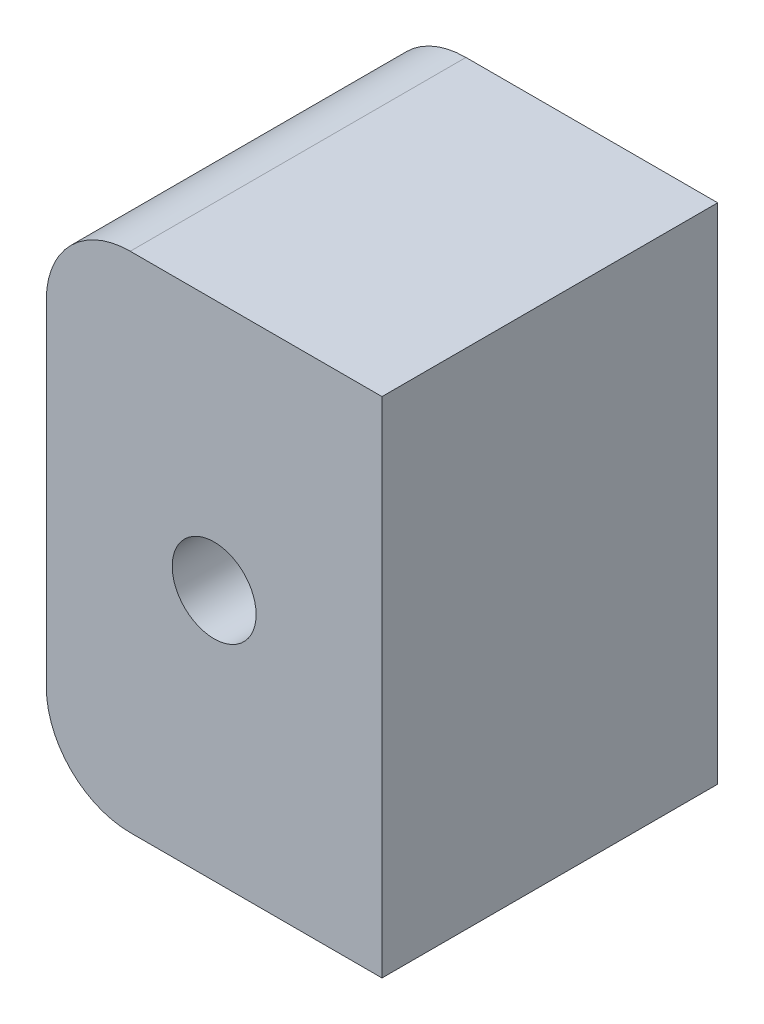
ISO-10303-21;
HEADER;
FILE_DESCRIPTION(('STEP AP214'),'2;1');
FILE_NAME('part.step','',(''),(''),'','','');
FILE_SCHEMA(('AUTOMOTIVE_DESIGN { 1 0 10303 214 1 1 1 1 }'));
ENDSEC;
DATA;
#1=APPLICATION_CONTEXT('core data for automotive mechanical design processes');
#2=APPLICATION_PROTOCOL_DEFINITION('international standard','automotive_design',2000,#1);
#3=PRODUCT_CONTEXT('',#1,'mechanical');
#4=PRODUCT('Part','Part','',(#3));
#5=PRODUCT_RELATED_PRODUCT_CATEGORY('part','',(#4));
#6=PRODUCT_DEFINITION_FORMATION('','',#4);
#7=PRODUCT_DEFINITION_CONTEXT('part definition',#1,'design');
#8=PRODUCT_DEFINITION('design','',#6,#7);
#9=PRODUCT_DEFINITION_SHAPE('','',#8);
#10=(LENGTH_UNIT() NAMED_UNIT(*) SI_UNIT(.MILLI.,.METRE.));
#11=(NAMED_UNIT(*) PLANE_ANGLE_UNIT() SI_UNIT($,.RADIAN.));
#12=(NAMED_UNIT(*) SI_UNIT($,.STERADIAN.) SOLID_ANGLE_UNIT());
#13=UNCERTAINTY_MEASURE_WITH_UNIT(LENGTH_MEASURE(1.E-05),#10,'distance_accuracy_value','');
#14=(GEOMETRIC_REPRESENTATION_CONTEXT(3) GLOBAL_UNCERTAINTY_ASSIGNED_CONTEXT((#13)) GLOBAL_UNIT_ASSIGNED_CONTEXT((#10,
#11,#12)) REPRESENTATION_CONTEXT('',''));
#15=CARTESIAN_POINT('',(0.,0.,0.));
#16=DIRECTION('',(0.,0.,1.));
#17=DIRECTION('',(1.,0.,0.));
#18=AXIS2_PLACEMENT_3D('',#15,#16,#17);
#19=CARTESIAN_POINT('',(0.,15.,20.));
#20=DIRECTION('',(-1.,0.,0.));
#21=DIRECTION('',(0.,-1.,0.));
#22=AXIS2_PLACEMENT_3D('',#19,#20,#21);
#23=PLANE('',#22);
#24=DIRECTION('',(0.,1.,0.));
#25=VECTOR('',#24,1.);
#26=CARTESIAN_POINT('',(0.,15.,0.));
#27=LINE('',#26,#25);
#28=CARTESIAN_POINT('',(0.,-15.,0.));
#29=VERTEX_POINT('',#28);
#30=CARTESIAN_POINT('',(0.,15.,0.));
#31=VERTEX_POINT('',#30);
#32=EDGE_CURVE('E136',#29,#31,#27,.T.);
#33=ORIENTED_EDGE('',*,*,#32,.T.);
#34=DIRECTION('',(0.,0.,-1.));
#35=VECTOR('',#34,1.);
#36=CARTESIAN_POINT('',(0.,15.,20.));
#37=LINE('',#36,#35);
#38=CARTESIAN_POINT('',(0.,15.,20.));
#39=VERTEX_POINT('',#38);
#40=EDGE_CURVE('E11',#39,#31,#37,.T.);
#41=ORIENTED_EDGE('',*,*,#40,.F.);
#42=DIRECTION('',(0.,1.,0.));
#43=VECTOR('',#42,1.);
#44=CARTESIAN_POINT('',(0.,15.,20.));
#45=LINE('',#44,#43);
#46=CARTESIAN_POINT('',(0.,-15.,20.));
#47=VERTEX_POINT('',#46);
#48=EDGE_CURVE('E153',#47,#39,#45,.T.);
#49=ORIENTED_EDGE('',*,*,#48,.F.);
#50=DIRECTION('',(0.,0.,-1.));
#51=VECTOR('',#50,1.);
#52=CARTESIAN_POINT('',(0.,-15.,20.));
#53=LINE('',#52,#51);
#54=EDGE_CURVE('E132',#47,#29,#53,.T.);
#55=ORIENTED_EDGE('',*,*,#54,.T.);
#56=EDGE_LOOP('',(#33,#41,#49,#55));
#57=FACE_BOUND('',#56,.T.);
#58=ADVANCED_FACE('F47',(#57),#23,.F.);
#59=CARTESIAN_POINT('',(-15.,15.,20.));
#60=DIRECTION('',(0.,-1.,0.));
#61=DIRECTION('',(1.,0.,0.));
#62=AXIS2_PLACEMENT_3D('',#59,#60,#61);
#63=PLANE('',#62);
#64=DIRECTION('',(-1.,0.,0.));
#65=VECTOR('',#64,1.);
#66=CARTESIAN_POINT('',(-15.,15.,0.));
#67=LINE('',#66,#65);
#68=CARTESIAN_POINT('',(-15.,15.,0.));
#69=VERTEX_POINT('',#68);
#70=EDGE_CURVE('E140',#31,#69,#67,.T.);
#71=ORIENTED_EDGE('',*,*,#70,.T.);
#72=DIRECTION('',(0.,0.,-1.));
#73=VECTOR('',#72,1.);
#74=CARTESIAN_POINT('',(-15.,15.,20.));
#75=LINE('',#74,#73);
#76=CARTESIAN_POINT('',(-15.,15.,20.));
#77=VERTEX_POINT('',#76);
#78=EDGE_CURVE('E56',#77,#69,#75,.T.);
#79=ORIENTED_EDGE('',*,*,#78,.F.);
#80=DIRECTION('',(-1.,0.,0.));
#81=VECTOR('',#80,1.);
#82=CARTESIAN_POINT('',(-15.,15.,20.));
#83=LINE('',#82,#81);
#84=EDGE_CURVE('E101',#39,#77,#83,.T.);
#85=ORIENTED_EDGE('',*,*,#84,.F.);
#86=ORIENTED_EDGE('',*,*,#40,.T.);
#87=EDGE_LOOP('',(#71,#79,#85,#86));
#88=FACE_BOUND('',#87,.T.);
#89=ADVANCED_FACE('F182',(#88),#63,.F.);
#90=CARTESIAN_POINT('',(-15.,10.,20.));
#91=DIRECTION('',(0.,0.,-1.));
#92=DIRECTION('',(-1.,0.,0.));
#93=AXIS2_PLACEMENT_3D('',#90,#91,#92);
#94=CYLINDRICAL_SURFACE('',#93,5.);
#95=CARTESIAN_POINT('',(-15.,10.,0.));
#96=DIRECTION('',(0.,0.,1.));
#97=DIRECTION('',(-1.,0.,0.));
#98=AXIS2_PLACEMENT_3D('',#95,#96,#97);
#99=CIRCLE('',#98,5.);
#100=CARTESIAN_POINT('',(-20.,10.,0.));
#101=VERTEX_POINT('',#100);
#102=EDGE_CURVE('E144',#69,#101,#99,.T.);
#103=ORIENTED_EDGE('',*,*,#102,.T.);
#104=DIRECTION('',(0.,0.,-1.));
#105=VECTOR('',#104,1.);
#106=CARTESIAN_POINT('',(-20.,10.,20.));
#107=LINE('',#106,#105);
#108=CARTESIAN_POINT('',(-20.,10.,20.));
#109=VERTEX_POINT('',#108);
#110=EDGE_CURVE('E125',#109,#101,#107,.T.);
#111=ORIENTED_EDGE('',*,*,#110,.F.);
#112=CARTESIAN_POINT('',(-15.,10.,20.));
#113=DIRECTION('',(0.,0.,1.));
#114=DIRECTION('',(-1.,0.,0.));
#115=AXIS2_PLACEMENT_3D('',#112,#113,#114);
#116=CIRCLE('',#115,5.);
#117=EDGE_CURVE('E114',#77,#109,#116,.T.);
#118=ORIENTED_EDGE('',*,*,#117,.F.);
#119=ORIENTED_EDGE('',*,*,#78,.T.);
#120=EDGE_LOOP('',(#103,#111,#118,#119));
#121=FACE_BOUND('',#120,.T.);
#122=ADVANCED_FACE('F163',(#121),#94,.T.);
#123=CARTESIAN_POINT('',(-20.,10.,20.));
#124=DIRECTION('',(1.,0.,0.));
#125=DIRECTION('',(0.,1.,0.));
#126=AXIS2_PLACEMENT_3D('',#123,#124,#125);
#127=PLANE('',#126);
#128=DIRECTION('',(0.,-1.,0.));
#129=VECTOR('',#128,1.);
#130=CARTESIAN_POINT('',(-20.,10.,0.));
#131=LINE('',#130,#129);
#132=CARTESIAN_POINT('',(-20.,-10.,0.));
#133=VERTEX_POINT('',#132);
#134=EDGE_CURVE('E123',#101,#133,#131,.T.);
#135=ORIENTED_EDGE('',*,*,#134,.T.);
#136=DIRECTION('',(0.,0.,-1.));
#137=VECTOR('',#136,1.);
#138=CARTESIAN_POINT('',(-20.,-10.,20.));
#139=LINE('',#138,#137);
#140=CARTESIAN_POINT('',(-20.,-10.,20.));
#141=VERTEX_POINT('',#140);
#142=EDGE_CURVE('E120',#141,#133,#139,.T.);
#143=ORIENTED_EDGE('',*,*,#142,.F.);
#144=DIRECTION('',(0.,-1.,0.));
#145=VECTOR('',#144,1.);
#146=CARTESIAN_POINT('',(-20.,10.,20.));
#147=LINE('',#146,#145);
#148=EDGE_CURVE('E108',#109,#141,#147,.T.);
#149=ORIENTED_EDGE('',*,*,#148,.F.);
#150=ORIENTED_EDGE('',*,*,#110,.T.);
#151=EDGE_LOOP('',(#135,#143,#149,#150));
#152=FACE_BOUND('',#151,.T.);
#153=ADVANCED_FACE('F121',(#152),#127,.F.);
#154=CARTESIAN_POINT('',(-15.,-10.,20.));
#155=DIRECTION('',(0.,0.,-1.));
#156=DIRECTION('',(-1.,0.,0.));
#157=AXIS2_PLACEMENT_3D('',#154,#155,#156);
#158=CYLINDRICAL_SURFACE('',#157,5.);
#159=CARTESIAN_POINT('',(-15.,-10.,0.));
#160=DIRECTION('',(0.,0.,1.));
#161=DIRECTION('',(1.,0.,0.));
#162=AXIS2_PLACEMENT_3D('',#159,#160,#161);
#163=CIRCLE('',#162,5.);
#164=CARTESIAN_POINT('',(-15.,-15.,0.));
#165=VERTEX_POINT('',#164);
#166=EDGE_CURVE('E87',#133,#165,#163,.T.);
#167=ORIENTED_EDGE('',*,*,#166,.T.);
#168=DIRECTION('',(0.,0.,-1.));
#169=VECTOR('',#168,1.);
#170=CARTESIAN_POINT('',(-15.,-15.,20.));
#171=LINE('',#170,#169);
#172=CARTESIAN_POINT('',(-15.,-15.,20.));
#173=VERTEX_POINT('',#172);
#174=EDGE_CURVE('E126',#173,#165,#171,.T.);
#175=ORIENTED_EDGE('',*,*,#174,.F.);
#176=CARTESIAN_POINT('',(-15.,-10.,20.));
#177=DIRECTION('',(0.,0.,1.));
#178=DIRECTION('',(1.,0.,0.));
#179=AXIS2_PLACEMENT_3D('',#176,#177,#178);
#180=CIRCLE('',#179,5.);
#181=EDGE_CURVE('E112',#141,#173,#180,.T.);
#182=ORIENTED_EDGE('',*,*,#181,.F.);
#183=ORIENTED_EDGE('',*,*,#142,.T.);
#184=EDGE_LOOP('',(#167,#175,#182,#183));
#185=FACE_BOUND('',#184,.T.);
#186=ADVANCED_FACE('F128',(#185),#158,.T.);
#187=CARTESIAN_POINT('',(-15.,-15.,20.));
#188=DIRECTION('',(0.,1.,0.));
#189=DIRECTION('',(-1.,0.,0.));
#190=AXIS2_PLACEMENT_3D('',#187,#188,#189);
#191=PLANE('',#190);
#192=DIRECTION('',(1.,0.,0.));
#193=VECTOR('',#192,1.);
#194=CARTESIAN_POINT('',(-15.,-15.,0.));
#195=LINE('',#194,#193);
#196=EDGE_CURVE('E93',#165,#29,#195,.T.);
#197=ORIENTED_EDGE('',*,*,#196,.T.);
#198=ORIENTED_EDGE('',*,*,#54,.F.);
#199=DIRECTION('',(1.,0.,0.));
#200=VECTOR('',#199,1.);
#201=CARTESIAN_POINT('',(-15.,-15.,20.));
#202=LINE('',#201,#200);
#203=EDGE_CURVE('E64',#173,#47,#202,.T.);
#204=ORIENTED_EDGE('',*,*,#203,.F.);
#205=ORIENTED_EDGE('',*,*,#174,.T.);
#206=EDGE_LOOP('',(#197,#198,#204,#205));
#207=FACE_BOUND('',#206,.T.);
#208=ADVANCED_FACE('F170',(#207),#191,.F.);
#209=CARTESIAN_POINT('',(-15.,-10.,20.));
#210=DIRECTION('',(0.,0.,1.));
#211=DIRECTION('',(1.,0.,0.));
#212=AXIS2_PLACEMENT_3D('',#209,#210,#211);
#213=PLANE('',#212);
#214=CARTESIAN_POINT('',(-9.99999999999999,0.,20.));
#215=DIRECTION('',(0.,0.,1.));
#216=DIRECTION('',(1.,0.,0.));
#217=AXIS2_PLACEMENT_3D('',#214,#215,#216);
#218=CIRCLE('',#217,2.5);
#219=CARTESIAN_POINT('',(-7.49999999999999,0.,20.));
#220=VERTEX_POINT('',#219);
#221=EDGE_CURVE('E141',#220,#220,#218,.T.);
#222=ORIENTED_EDGE('',*,*,#221,.F.);
#223=EDGE_LOOP('',(#222));
#224=FACE_BOUND('',#223,.T.);
#225=ORIENTED_EDGE('',*,*,#48,.T.);
#226=ORIENTED_EDGE('',*,*,#84,.T.);
#227=ORIENTED_EDGE('',*,*,#117,.T.);
#228=ORIENTED_EDGE('',*,*,#148,.T.);
#229=ORIENTED_EDGE('',*,*,#181,.T.);
#230=ORIENTED_EDGE('',*,*,#203,.T.);
#231=EDGE_LOOP('',(#225,#226,#227,#228,#229,#230));
#232=FACE_BOUND('',#231,.T.);
#233=ADVANCED_FACE('F110',(#224,#232),#213,.T.);
#234=CARTESIAN_POINT('',(-15.,-10.,0.));
#235=DIRECTION('',(0.,0.,1.));
#236=DIRECTION('',(1.,0.,0.));
#237=AXIS2_PLACEMENT_3D('',#234,#235,#236);
#238=PLANE('',#237);
#239=CARTESIAN_POINT('',(-9.99999999999999,0.,0.));
#240=DIRECTION('',(0.,0.,1.));
#241=DIRECTION('',(1.,0.,0.));
#242=AXIS2_PLACEMENT_3D('',#239,#240,#241);
#243=CIRCLE('',#242,2.5);
#244=CARTESIAN_POINT('',(-7.49999999999999,0.,0.));
#245=VERTEX_POINT('',#244);
#246=EDGE_CURVE('E238',#245,#245,#243,.T.);
#247=ORIENTED_EDGE('',*,*,#246,.T.);
#248=EDGE_LOOP('',(#247));
#249=FACE_BOUND('',#248,.T.);
#250=ORIENTED_EDGE('',*,*,#32,.F.);
#251=ORIENTED_EDGE('',*,*,#196,.F.);
#252=ORIENTED_EDGE('',*,*,#166,.F.);
#253=ORIENTED_EDGE('',*,*,#134,.F.);
#254=ORIENTED_EDGE('',*,*,#102,.F.);
#255=ORIENTED_EDGE('',*,*,#70,.F.);
#256=EDGE_LOOP('',(#250,#251,#252,#253,#254,#255));
#257=FACE_BOUND('',#256,.T.);
#258=ADVANCED_FACE('F166',(#249,#257),#238,.F.);
#259=CARTESIAN_POINT('',(-9.99999999999999,0.,0.));
#260=DIRECTION('',(0.,0.,1.));
#261=DIRECTION('',(1.,0.,0.));
#262=AXIS2_PLACEMENT_3D('',#259,#260,#261);
#263=CYLINDRICAL_SURFACE('',#262,2.5);
#264=ORIENTED_EDGE('',*,*,#221,.T.);
#265=EDGE_LOOP('',(#264));
#266=FACE_BOUND('',#265,.T.);
#267=ORIENTED_EDGE('',*,*,#246,.F.);
#268=EDGE_LOOP('',(#267));
#269=FACE_BOUND('',#268,.T.);
#270=ADVANCED_FACE('F221',(#266,#269),#263,.F.);
#271=CLOSED_SHELL('',(#58,#89,#122,#153,#186,#208,#233,#258,#270));
#272=MANIFOLD_SOLID_BREP('B2',#271);
#273=ADVANCED_BREP_SHAPE_REPRESENTATION('',(#18,#272),#14);
#274=SHAPE_DEFINITION_REPRESENTATION(#9,#273);
ENDSEC;
END-ISO-10303-21;
